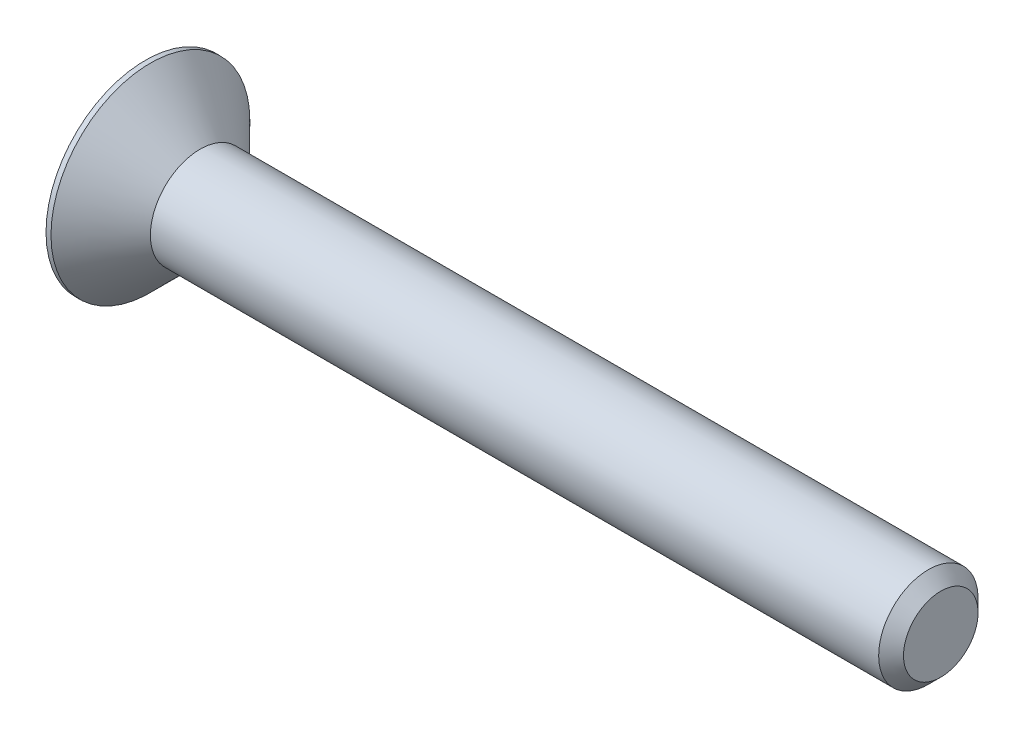
ISO-10303-21;
HEADER;
FILE_DESCRIPTION(('STEP AP214'),'2;1');
FILE_NAME('part.step','',(''),(''),'','','');
FILE_SCHEMA(('AUTOMOTIVE_DESIGN { 1 0 10303 214 1 1 1 1 }'));
ENDSEC;
DATA;
#1=APPLICATION_CONTEXT('core data for automotive mechanical design processes');
#2=APPLICATION_PROTOCOL_DEFINITION('international standard','automotive_design',2000,#1);
#3=PRODUCT_CONTEXT('',#1,'mechanical');
#4=PRODUCT('Part','Part','',(#3));
#5=PRODUCT_RELATED_PRODUCT_CATEGORY('part','',(#4));
#6=PRODUCT_DEFINITION_FORMATION('','',#4);
#7=PRODUCT_DEFINITION_CONTEXT('part definition',#1,'design');
#8=PRODUCT_DEFINITION('design','',#6,#7);
#9=PRODUCT_DEFINITION_SHAPE('','',#8);
#10=(LENGTH_UNIT() NAMED_UNIT(*) SI_UNIT(.MILLI.,.METRE.));
#11=(NAMED_UNIT(*) PLANE_ANGLE_UNIT() SI_UNIT($,.RADIAN.));
#12=(NAMED_UNIT(*) SI_UNIT($,.STERADIAN.) SOLID_ANGLE_UNIT());
#13=UNCERTAINTY_MEASURE_WITH_UNIT(LENGTH_MEASURE(1.E-05),#10,'distance_accuracy_value','');
#14=(GEOMETRIC_REPRESENTATION_CONTEXT(3) GLOBAL_UNCERTAINTY_ASSIGNED_CONTEXT((#13)) GLOBAL_UNIT_ASSIGNED_CONTEXT((#10,
#11,#12)) REPRESENTATION_CONTEXT('',''));
#15=CARTESIAN_POINT('',(0.,0.,0.));
#16=DIRECTION('',(0.,0.,1.));
#17=DIRECTION('',(1.,0.,0.));
#18=AXIS2_PLACEMENT_3D('',#15,#16,#17);
#19=CARTESIAN_POINT('',(0.,0.,0.));
#20=DIRECTION('',(1.,0.,0.));
#21=DIRECTION('',(0.,0.,-1.));
#22=AXIS2_PLACEMENT_3D('',#19,#20,#21);
#23=PLANE('',#22);
#24=DIRECTION('',(0.,0.866025403784439,0.5));
#25=VECTOR('',#24,1.);
#26=CARTESIAN_POINT('',(0.,-0.75,0.433012701892219));
#27=LINE('',#26,#25);
#28=CARTESIAN_POINT('',(0.,-0.75,0.433012701892219));
#29=VERTEX_POINT('',#28);
#30=CARTESIAN_POINT('',(0.,0.,0.866025403784438));
#31=VERTEX_POINT('',#30);
#32=EDGE_CURVE('E122',#29,#31,#27,.T.);
#33=ORIENTED_EDGE('',*,*,#32,.F.);
#34=DIRECTION('',(0.,0.,1.));
#35=VECTOR('',#34,1.);
#36=CARTESIAN_POINT('',(0.,-0.75,-0.43301270189222));
#37=LINE('',#36,#35);
#38=CARTESIAN_POINT('',(0.,-0.75,-0.43301270189222));
#39=VERTEX_POINT('',#38);
#40=EDGE_CURVE('E48',#39,#29,#37,.T.);
#41=ORIENTED_EDGE('',*,*,#40,.F.);
#42=DIRECTION('',(0.,-0.866025403784439,0.5));
#43=VECTOR('',#42,1.);
#44=CARTESIAN_POINT('',(0.,0.,-0.866025403784439));
#45=LINE('',#44,#43);
#46=CARTESIAN_POINT('',(0.,0.,-0.866025403784439));
#47=VERTEX_POINT('',#46);
#48=EDGE_CURVE('E131',#47,#39,#45,.T.);
#49=ORIENTED_EDGE('',*,*,#48,.F.);
#50=DIRECTION('',(0.,-0.866025403784439,-0.5));
#51=VECTOR('',#50,1.);
#52=CARTESIAN_POINT('',(0.,0.75,-0.43301270189222));
#53=LINE('',#52,#51);
#54=CARTESIAN_POINT('',(0.,0.75,-0.43301270189222));
#55=VERTEX_POINT('',#54);
#56=EDGE_CURVE('E129',#55,#47,#53,.T.);
#57=ORIENTED_EDGE('',*,*,#56,.F.);
#58=DIRECTION('',(0.,0.,-1.));
#59=VECTOR('',#58,1.);
#60=CARTESIAN_POINT('',(0.,0.75,0.433012701892219));
#61=LINE('',#60,#59);
#62=CARTESIAN_POINT('',(0.,0.75,0.433012701892219));
#63=VERTEX_POINT('',#62);
#64=EDGE_CURVE('E96',#63,#55,#61,.T.);
#65=ORIENTED_EDGE('',*,*,#64,.F.);
#66=DIRECTION('',(0.,0.866025403784439,-0.5));
#67=VECTOR('',#66,1.);
#68=CARTESIAN_POINT('',(0.,0.,0.866025403784438));
#69=LINE('',#68,#67);
#70=EDGE_CURVE('E125',#31,#63,#69,.T.);
#71=ORIENTED_EDGE('',*,*,#70,.F.);
#72=EDGE_LOOP('',(#33,#41,#49,#57,#65,#71));
#73=FACE_BOUND('',#72,.T.);
#74=CARTESIAN_POINT('',(0.,0.,0.));
#75=DIRECTION('',(-1.,0.,0.));
#76=DIRECTION('',(0.,0.,1.));
#77=AXIS2_PLACEMENT_3D('',#74,#75,#76);
#78=CIRCLE('',#77,2.);
#79=CARTESIAN_POINT('',(0.,0.,2.));
#80=VERTEX_POINT('',#79);
#81=EDGE_CURVE('E11',#80,#80,#78,.T.);
#82=ORIENTED_EDGE('',*,*,#81,.T.);
#83=EDGE_LOOP('',(#82));
#84=FACE_BOUND('',#83,.T.);
#85=ADVANCED_FACE('F34',(#73,#84),#23,.F.);
#86=CARTESIAN_POINT('',(-2.28184155946539,0.,0.));
#87=DIRECTION('',(-1.,0.,0.));
#88=DIRECTION('',(0.,0.,1.));
#89=AXIS2_PLACEMENT_3D('',#86,#87,#88);
#90=CYLINDRICAL_SURFACE('',#89,2.);
#91=ORIENTED_EDGE('',*,*,#81,.F.);
#92=EDGE_LOOP('',(#91));
#93=FACE_BOUND('',#92,.T.);
#94=CARTESIAN_POINT('',(0.0999999999999998,0.,0.));
#95=DIRECTION('',(-1.,0.,0.));
#96=DIRECTION('',(0.,0.,1.));
#97=AXIS2_PLACEMENT_3D('',#94,#95,#96);
#98=CIRCLE('',#97,2.);
#99=CARTESIAN_POINT('',(0.0999999999999998,0.,2.));
#100=VERTEX_POINT('',#99);
#101=EDGE_CURVE('E41',#100,#100,#98,.T.);
#102=ORIENTED_EDGE('',*,*,#101,.T.);
#103=EDGE_LOOP('',(#102));
#104=FACE_BOUND('',#103,.T.);
#105=ADVANCED_FACE('F151',(#93,#104),#90,.T.);
#106=CARTESIAN_POINT('',(1.1,0.,0.));
#107=DIRECTION('',(-1.,0.,0.));
#108=DIRECTION('',(0.,0.,1.));
#109=AXIS2_PLACEMENT_3D('',#106,#107,#108);
#110=CONICAL_SURFACE('',#109,1.,0.78539816339745);
#111=ORIENTED_EDGE('',*,*,#101,.F.);
#112=EDGE_LOOP('',(#111));
#113=FACE_BOUND('',#112,.T.);
#114=CARTESIAN_POINT('',(1.1,0.,0.));
#115=DIRECTION('',(-1.,0.,0.));
#116=DIRECTION('',(0.,0.,1.));
#117=AXIS2_PLACEMENT_3D('',#114,#115,#116);
#118=CIRCLE('',#117,1.);
#119=CARTESIAN_POINT('',(1.1,0.,1.));
#120=VERTEX_POINT('',#119);
#121=EDGE_CURVE('E146',#120,#120,#118,.T.);
#122=ORIENTED_EDGE('',*,*,#121,.T.);
#123=EDGE_LOOP('',(#122));
#124=FACE_BOUND('',#123,.T.);
#125=ADVANCED_FACE('F153',(#113,#124),#110,.T.);
#126=CARTESIAN_POINT('',(-2.28184155946539,0.,0.));
#127=DIRECTION('',(-1.,0.,0.));
#128=DIRECTION('',(0.,0.,1.));
#129=AXIS2_PLACEMENT_3D('',#126,#127,#128);
#130=CYLINDRICAL_SURFACE('',#129,1.);
#131=ORIENTED_EDGE('',*,*,#121,.F.);
#132=EDGE_LOOP('',(#131));
#133=FACE_BOUND('',#132,.T.);
#134=CARTESIAN_POINT('',(15.75,0.,0.));
#135=DIRECTION('',(-1.,0.,0.));
#136=DIRECTION('',(0.,0.,1.));
#137=AXIS2_PLACEMENT_3D('',#134,#135,#136);
#138=CIRCLE('',#137,1.);
#139=CARTESIAN_POINT('',(15.75,0.,1.));
#140=VERTEX_POINT('',#139);
#141=EDGE_CURVE('E143',#140,#140,#138,.T.);
#142=ORIENTED_EDGE('',*,*,#141,.T.);
#143=EDGE_LOOP('',(#142));
#144=FACE_BOUND('',#143,.T.);
#145=ADVANCED_FACE('F156',(#133,#144),#130,.T.);
#146=CARTESIAN_POINT('',(16.,0.,0.));
#147=DIRECTION('',(-1.,0.,0.));
#148=DIRECTION('',(0.,0.,1.));
#149=AXIS2_PLACEMENT_3D('',#146,#147,#148);
#150=CONICAL_SURFACE('',#149,0.75,0.785398163397448);
#151=ORIENTED_EDGE('',*,*,#141,.F.);
#152=EDGE_LOOP('',(#151));
#153=FACE_BOUND('',#152,.T.);
#154=CARTESIAN_POINT('',(16.,0.,0.));
#155=DIRECTION('',(-1.,0.,0.));
#156=DIRECTION('',(0.,0.,1.));
#157=AXIS2_PLACEMENT_3D('',#154,#155,#156);
#158=CIRCLE('',#157,0.75);
#159=CARTESIAN_POINT('',(16.,0.,0.75));
#160=VERTEX_POINT('',#159);
#161=EDGE_CURVE('E135',#160,#160,#158,.T.);
#162=ORIENTED_EDGE('',*,*,#161,.T.);
#163=EDGE_LOOP('',(#162));
#164=FACE_BOUND('',#163,.T.);
#165=ADVANCED_FACE('F162',(#153,#164),#150,.T.);
#166=CARTESIAN_POINT('',(16.,0.75,0.));
#167=DIRECTION('',(-1.,0.,0.));
#168=DIRECTION('',(0.,0.,1.));
#169=AXIS2_PLACEMENT_3D('',#166,#167,#168);
#170=PLANE('',#169);
#171=ORIENTED_EDGE('',*,*,#161,.F.);
#172=EDGE_LOOP('',(#171));
#173=FACE_BOUND('',#172,.T.);
#174=ADVANCED_FACE('F168',(#173),#170,.F.);
#175=CARTESIAN_POINT('',(0.8,-0.75,-0.43301270189222));
#176=DIRECTION('',(0.,-1.,0.));
#177=DIRECTION('',(0.,0.,-1.));
#178=AXIS2_PLACEMENT_3D('',#175,#176,#177);
#179=PLANE('',#178);
#180=ORIENTED_EDGE('',*,*,#40,.T.);
#181=DIRECTION('',(-1.,0.,0.));
#182=VECTOR('',#181,1.);
#183=CARTESIAN_POINT('',(0.8,-0.75,0.433012701892219));
#184=LINE('',#183,#182);
#185=CARTESIAN_POINT('',(0.8,-0.75,0.433012701892219));
#186=VERTEX_POINT('',#185);
#187=EDGE_CURVE('E78',#186,#29,#184,.T.);
#188=ORIENTED_EDGE('',*,*,#187,.F.);
#189=DIRECTION('',(0.,0.,1.));
#190=VECTOR('',#189,1.);
#191=CARTESIAN_POINT('',(0.8,-0.75,-0.43301270189222));
#192=LINE('',#191,#190);
#193=CARTESIAN_POINT('',(0.8,-0.75,-0.43301270189222));
#194=VERTEX_POINT('',#193);
#195=EDGE_CURVE('E133',#194,#186,#192,.T.);
#196=ORIENTED_EDGE('',*,*,#195,.F.);
#197=DIRECTION('',(-1.,0.,0.));
#198=VECTOR('',#197,1.);
#199=CARTESIAN_POINT('',(0.8,-0.75,-0.43301270189222));
#200=LINE('',#199,#198);
#201=EDGE_CURVE('E56',#194,#39,#200,.T.);
#202=ORIENTED_EDGE('',*,*,#201,.T.);
#203=EDGE_LOOP('',(#180,#188,#196,#202));
#204=FACE_BOUND('',#203,.T.);
#205=ADVANCED_FACE('F173',(#204),#179,.F.);
#206=CARTESIAN_POINT('',(0.8,0.,-0.866025403784439));
#207=DIRECTION('',(0.,-0.5,-0.866025403784439));
#208=DIRECTION('',(0.,0.866025403784439,-0.5));
#209=AXIS2_PLACEMENT_3D('',#206,#207,#208);
#210=PLANE('',#209);
#211=ORIENTED_EDGE('',*,*,#48,.T.);
#212=ORIENTED_EDGE('',*,*,#201,.F.);
#213=DIRECTION('',(0.,-0.866025403784439,0.5));
#214=VECTOR('',#213,1.);
#215=CARTESIAN_POINT('',(0.8,0.,-0.866025403784439));
#216=LINE('',#215,#214);
#217=CARTESIAN_POINT('',(0.8,0.,-0.866025403784439));
#218=VERTEX_POINT('',#217);
#219=EDGE_CURVE('E108',#218,#194,#216,.T.);
#220=ORIENTED_EDGE('',*,*,#219,.F.);
#221=DIRECTION('',(-1.,0.,0.));
#222=VECTOR('',#221,1.);
#223=CARTESIAN_POINT('',(0.8,0.,-0.866025403784439));
#224=LINE('',#223,#222);
#225=EDGE_CURVE('E100',#218,#47,#224,.T.);
#226=ORIENTED_EDGE('',*,*,#225,.T.);
#227=EDGE_LOOP('',(#211,#212,#220,#226));
#228=FACE_BOUND('',#227,.T.);
#229=ADVANCED_FACE('F178',(#228),#210,.F.);
#230=CARTESIAN_POINT('',(0.8,0.75,-0.43301270189222));
#231=DIRECTION('',(0.,0.5,-0.866025403784439));
#232=DIRECTION('',(0.,0.866025403784439,0.5));
#233=AXIS2_PLACEMENT_3D('',#230,#231,#232);
#234=PLANE('',#233);
#235=ORIENTED_EDGE('',*,*,#56,.T.);
#236=ORIENTED_EDGE('',*,*,#225,.F.);
#237=DIRECTION('',(0.,-0.866025403784439,-0.5));
#238=VECTOR('',#237,1.);
#239=CARTESIAN_POINT('',(0.8,0.75,-0.43301270189222));
#240=LINE('',#239,#238);
#241=CARTESIAN_POINT('',(0.8,0.75,-0.43301270189222));
#242=VERTEX_POINT('',#241);
#243=EDGE_CURVE('E104',#242,#218,#240,.T.);
#244=ORIENTED_EDGE('',*,*,#243,.F.);
#245=DIRECTION('',(-1.,0.,0.));
#246=VECTOR('',#245,1.);
#247=CARTESIAN_POINT('',(0.8,0.75,-0.43301270189222));
#248=LINE('',#247,#246);
#249=EDGE_CURVE('E89',#242,#55,#248,.T.);
#250=ORIENTED_EDGE('',*,*,#249,.T.);
#251=EDGE_LOOP('',(#235,#236,#244,#250));
#252=FACE_BOUND('',#251,.T.);
#253=ADVANCED_FACE('F105',(#252),#234,.F.);
#254=CARTESIAN_POINT('',(0.8,0.75,0.433012701892219));
#255=DIRECTION('',(0.,1.,0.));
#256=DIRECTION('',(0.,0.,1.));
#257=AXIS2_PLACEMENT_3D('',#254,#255,#256);
#258=PLANE('',#257);
#259=ORIENTED_EDGE('',*,*,#64,.T.);
#260=ORIENTED_EDGE('',*,*,#249,.F.);
#261=DIRECTION('',(0.,0.,-1.));
#262=VECTOR('',#261,1.);
#263=CARTESIAN_POINT('',(0.8,0.75,0.433012701892219));
#264=LINE('',#263,#262);
#265=CARTESIAN_POINT('',(0.8,0.75,0.433012701892219));
#266=VERTEX_POINT('',#265);
#267=EDGE_CURVE('E93',#266,#242,#264,.T.);
#268=ORIENTED_EDGE('',*,*,#267,.F.);
#269=DIRECTION('',(-1.,0.,0.));
#270=VECTOR('',#269,1.);
#271=CARTESIAN_POINT('',(0.8,0.75,0.433012701892219));
#272=LINE('',#271,#270);
#273=EDGE_CURVE('E101',#266,#63,#272,.T.);
#274=ORIENTED_EDGE('',*,*,#273,.T.);
#275=EDGE_LOOP('',(#259,#260,#268,#274));
#276=FACE_BOUND('',#275,.T.);
#277=ADVANCED_FACE('F91',(#276),#258,.F.);
#278=CARTESIAN_POINT('',(0.8,0.,0.866025403784438));
#279=DIRECTION('',(0.,0.5,0.866025403784439));
#280=DIRECTION('',(0.,-0.866025403784439,0.5));
#281=AXIS2_PLACEMENT_3D('',#278,#279,#280);
#282=PLANE('',#281);
#283=ORIENTED_EDGE('',*,*,#70,.T.);
#284=ORIENTED_EDGE('',*,*,#273,.F.);
#285=DIRECTION('',(0.,0.866025403784439,-0.5));
#286=VECTOR('',#285,1.);
#287=CARTESIAN_POINT('',(0.8,0.,0.866025403784438));
#288=LINE('',#287,#286);
#289=CARTESIAN_POINT('',(0.8,0.,0.866025403784438));
#290=VERTEX_POINT('',#289);
#291=EDGE_CURVE('E114',#290,#266,#288,.T.);
#292=ORIENTED_EDGE('',*,*,#291,.F.);
#293=DIRECTION('',(-1.,0.,0.));
#294=VECTOR('',#293,1.);
#295=CARTESIAN_POINT('',(0.8,0.,0.866025403784438));
#296=LINE('',#295,#294);
#297=EDGE_CURVE('E138',#290,#31,#296,.T.);
#298=ORIENTED_EDGE('',*,*,#297,.T.);
#299=EDGE_LOOP('',(#283,#284,#292,#298));
#300=FACE_BOUND('',#299,.T.);
#301=ADVANCED_FACE('F204',(#300),#282,.F.);
#302=CARTESIAN_POINT('',(0.8,-0.75,0.433012701892219));
#303=DIRECTION('',(0.,-0.5,0.866025403784439));
#304=DIRECTION('',(0.,-0.866025403784439,-0.5));
#305=AXIS2_PLACEMENT_3D('',#302,#303,#304);
#306=PLANE('',#305);
#307=ORIENTED_EDGE('',*,*,#32,.T.);
#308=ORIENTED_EDGE('',*,*,#297,.F.);
#309=DIRECTION('',(0.,0.866025403784439,0.5));
#310=VECTOR('',#309,1.);
#311=CARTESIAN_POINT('',(0.8,-0.75,0.433012701892219));
#312=LINE('',#311,#310);
#313=EDGE_CURVE('E116',#186,#290,#312,.T.);
#314=ORIENTED_EDGE('',*,*,#313,.F.);
#315=ORIENTED_EDGE('',*,*,#187,.T.);
#316=EDGE_LOOP('',(#307,#308,#314,#315));
#317=FACE_BOUND('',#316,.T.);
#318=ADVANCED_FACE('F192',(#317),#306,.F.);
#319=CARTESIAN_POINT('',(0.8,0.,0.));
#320=DIRECTION('',(-1.,0.,0.));
#321=DIRECTION('',(0.,0.,1.));
#322=AXIS2_PLACEMENT_3D('',#319,#320,#321);
#323=PLANE('',#322);
#324=ORIENTED_EDGE('',*,*,#195,.T.);
#325=ORIENTED_EDGE('',*,*,#313,.T.);
#326=ORIENTED_EDGE('',*,*,#291,.T.);
#327=ORIENTED_EDGE('',*,*,#267,.T.);
#328=ORIENTED_EDGE('',*,*,#243,.T.);
#329=ORIENTED_EDGE('',*,*,#219,.T.);
#330=EDGE_LOOP('',(#324,#325,#326,#327,#328,#329));
#331=FACE_BOUND('',#330,.T.);
#332=ADVANCED_FACE('F111',(#331),#323,.T.);
#333=CLOSED_SHELL('',(#85,#105,#125,#145,#165,#174,#205,#229,#253,#277,#301,#318,#332));
#334=MANIFOLD_SOLID_BREP('B2',#333);
#335=ADVANCED_BREP_SHAPE_REPRESENTATION('',(#18,#334),#14);
#336=SHAPE_DEFINITION_REPRESENTATION(#9,#335);
ENDSEC;
END-ISO-10303-21;
